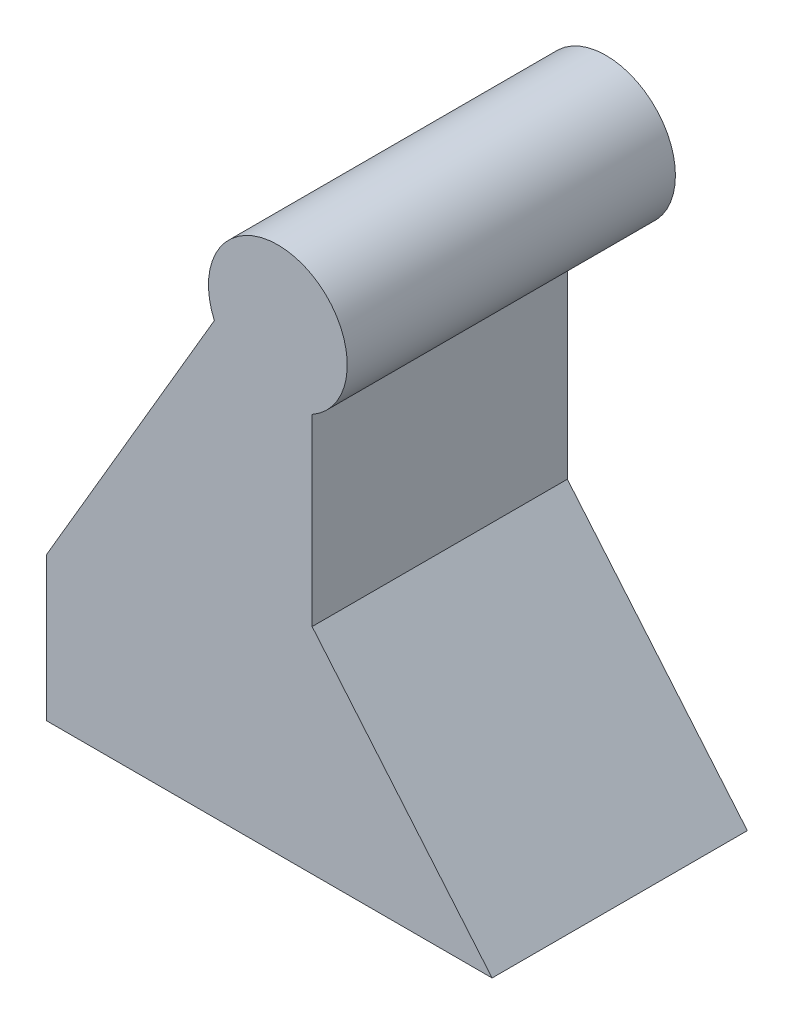
ISO-10303-21;
HEADER;
FILE_DESCRIPTION(('STEP AP214'),'2;1');
FILE_NAME('part.step','',(''),(''),'','','');
FILE_SCHEMA(('AUTOMOTIVE_DESIGN { 1 0 10303 214 1 1 1 1 }'));
ENDSEC;
DATA;
#1=APPLICATION_CONTEXT('core data for automotive mechanical design processes');
#2=APPLICATION_PROTOCOL_DEFINITION('international standard','automotive_design',2000,#1);
#3=PRODUCT_CONTEXT('',#1,'mechanical');
#4=PRODUCT('Part','Part','',(#3));
#5=PRODUCT_RELATED_PRODUCT_CATEGORY('part','',(#4));
#6=PRODUCT_DEFINITION_FORMATION('','',#4);
#7=PRODUCT_DEFINITION_CONTEXT('part definition',#1,'design');
#8=PRODUCT_DEFINITION('design','',#6,#7);
#9=PRODUCT_DEFINITION_SHAPE('','',#8);
#10=(LENGTH_UNIT() NAMED_UNIT(*) SI_UNIT(.MILLI.,.METRE.));
#11=(NAMED_UNIT(*) PLANE_ANGLE_UNIT() SI_UNIT($,.RADIAN.));
#12=(NAMED_UNIT(*) SI_UNIT($,.STERADIAN.) SOLID_ANGLE_UNIT());
#13=UNCERTAINTY_MEASURE_WITH_UNIT(LENGTH_MEASURE(1.E-05),#10,'distance_accuracy_value','');
#14=(GEOMETRIC_REPRESENTATION_CONTEXT(3) GLOBAL_UNCERTAINTY_ASSIGNED_CONTEXT((#13)) GLOBAL_UNIT_ASSIGNED_CONTEXT((#10,
#11,#12)) REPRESENTATION_CONTEXT('',''));
#15=CARTESIAN_POINT('',(0.,0.,0.));
#16=DIRECTION('',(0.,0.,1.));
#17=DIRECTION('',(1.,0.,0.));
#18=AXIS2_PLACEMENT_3D('',#15,#16,#17);
#19=CARTESIAN_POINT('',(-74.3157696242232,-7.94999958746374,10.));
#20=DIRECTION('',(0.,0.,-1.));
#21=DIRECTION('',(-1.,0.,0.));
#22=AXIS2_PLACEMENT_3D('',#19,#20,#21);
#23=CYLINDRICAL_SURFACE('',#22,9.51674665320932);
#24=CARTESIAN_POINT('',(-74.3157696242232,-7.94999958746374,-10.));
#25=DIRECTION('',(0.,0.,1.));
#26=DIRECTION('',(1.,0.,0.));
#27=AXIS2_PLACEMENT_3D('',#24,#25,#26);
#28=CIRCLE('',#27,9.51674665320932);
#29=CARTESIAN_POINT('',(-64.7990229710139,-7.94999958746374,-10.));
#30=VERTEX_POINT('',#29);
#31=EDGE_CURVE('E92',#30,#30,#28,.T.);
#32=ORIENTED_EDGE('',*,*,#31,.T.);
#33=EDGE_LOOP('',(#32));
#34=FACE_BOUND('',#33,.T.);
#35=DIRECTION('',(0.,0.,-1.));
#36=VECTOR('',#35,1.);
#37=CARTESIAN_POINT('',(-83.025654753467,-11.7848878383452,10.));
#38=LINE('',#37,#36);
#39=CARTESIAN_POINT('',(-83.025654753467,-11.7848878383452,35.));
#40=VERTEX_POINT('',#39);
#41=CARTESIAN_POINT('',(-83.025654753467,-11.7848878383452,0.));
#42=VERTEX_POINT('',#41);
#43=EDGE_CURVE('E11',#40,#42,#38,.T.);
#44=ORIENTED_EDGE('',*,*,#43,.F.);
#45=CARTESIAN_POINT('',(-74.3157696242232,-7.94999958746374,35.));
#46=DIRECTION('',(0.,0.,1.));
#47=DIRECTION('',(1.,0.,0.));
#48=AXIS2_PLACEMENT_3D('',#45,#46,#47);
#49=CIRCLE('',#48,9.51674665320932);
#50=CARTESIAN_POINT('',(-69.6204400406327,-16.2278221853956,35.));
#51=VERTEX_POINT('',#50);
#52=EDGE_CURVE('E94',#51,#40,#49,.T.);
#53=ORIENTED_EDGE('',*,*,#52,.F.);
#54=DIRECTION('',(0.,0.,-1.));
#55=VECTOR('',#54,1.);
#56=CARTESIAN_POINT('',(-69.6204400406327,-16.2278221853956,10.));
#57=LINE('',#56,#55);
#58=CARTESIAN_POINT('',(-69.6204400406327,-16.2278221853956,0.));
#59=VERTEX_POINT('',#58);
#60=EDGE_CURVE('E40',#59,#51,#57,.F.);
#61=ORIENTED_EDGE('',*,*,#60,.F.);
#62=CARTESIAN_POINT('',(-74.3157696242232,-7.94999958746374,0.));
#63=DIRECTION('',(0.,0.,-1.));
#64=DIRECTION('',(1.,0.,0.));
#65=AXIS2_PLACEMENT_3D('',#62,#63,#64);
#66=CIRCLE('',#65,9.51674665320932);
#67=EDGE_CURVE('E47',#59,#42,#66,.T.);
#68=ORIENTED_EDGE('',*,*,#67,.T.);
#69=EDGE_LOOP('',(#44,#53,#61,#68));
#70=FACE_BOUND('',#69,.T.);
#71=ADVANCED_FACE('F33',(#34,#70),#23,.T.);
#72=CARTESIAN_POINT('',(-74.3157696242232,-7.94999958746374,10.));
#73=DIRECTION('',(0.,0.,-1.));
#74=DIRECTION('',(-1.,0.,0.));
#75=AXIS2_PLACEMENT_3D('',#72,#73,#74);
#76=CYLINDRICAL_SURFACE('',#75,4.30973614586794);
#77=CARTESIAN_POINT('',(-74.3157696242232,-7.94999958746374,10.));
#78=DIRECTION('',(0.,0.,1.));
#79=DIRECTION('',(1.,0.,0.));
#80=AXIS2_PLACEMENT_3D('',#77,#78,#79);
#81=CIRCLE('',#80,4.30973614586794);
#82=CARTESIAN_POINT('',(-70.0060334783553,-7.94999958746374,10.));
#83=VERTEX_POINT('',#82);
#84=EDGE_CURVE('E96',#83,#83,#81,.T.);
#85=ORIENTED_EDGE('',*,*,#84,.T.);
#86=EDGE_LOOP('',(#85));
#87=FACE_BOUND('',#86,.T.);
#88=CARTESIAN_POINT('',(-74.3157696242232,-7.94999958746374,-10.));
#89=DIRECTION('',(0.,0.,1.));
#90=DIRECTION('',(1.,0.,0.));
#91=AXIS2_PLACEMENT_3D('',#88,#89,#90);
#92=CIRCLE('',#91,4.30973614586794);
#93=CARTESIAN_POINT('',(-70.0060334783553,-7.94999958746374,-10.));
#94=VERTEX_POINT('',#93);
#95=EDGE_CURVE('E113',#94,#94,#92,.T.);
#96=ORIENTED_EDGE('',*,*,#95,.F.);
#97=EDGE_LOOP('',(#96));
#98=FACE_BOUND('',#97,.T.);
#99=ADVANCED_FACE('F123',(#87,#98),#76,.F.);
#100=CARTESIAN_POINT('',(-74.3157696242232,-7.94999958746374,-10.));
#101=DIRECTION('',(0.,0.,1.));
#102=DIRECTION('',(1.,0.,0.));
#103=AXIS2_PLACEMENT_3D('',#100,#101,#102);
#104=PLANE('',#103);
#105=ORIENTED_EDGE('',*,*,#95,.T.);
#106=EDGE_LOOP('',(#105));
#107=FACE_BOUND('',#106,.T.);
#108=ORIENTED_EDGE('',*,*,#31,.F.);
#109=EDGE_LOOP('',(#108));
#110=FACE_BOUND('',#109,.T.);
#111=ADVANCED_FACE('F120',(#107,#110),#104,.F.);
#112=CARTESIAN_POINT('',(-83.025654753467,-11.7848878383452,35.));
#113=DIRECTION('',(0.862908086086389,-0.505360895763339,0.));
#114=DIRECTION('',(0.505360895763339,0.862908086086389,0.));
#115=AXIS2_PLACEMENT_3D('',#112,#113,#114);
#116=PLANE('',#115);
#117=DIRECTION('',(-0.505360895763339,-0.862908086086389,0.));
#118=VECTOR('',#117,1.);
#119=CARTESIAN_POINT('',(-83.025654753467,-11.7848878383452,35.));
#120=LINE('',#119,#118);
#121=CARTESIAN_POINT('',(-106.019653854858,-51.0473395286033,35.));
#122=VERTEX_POINT('',#121);
#123=EDGE_CURVE('E270',#40,#122,#120,.T.);
#124=ORIENTED_EDGE('',*,*,#123,.F.);
#125=ORIENTED_EDGE('',*,*,#43,.T.);
#126=DIRECTION('',(-0.505360895763339,-0.862908086086389,0.));
#127=VECTOR('',#126,1.);
#128=CARTESIAN_POINT('',(-83.025654753467,-11.7848878383452,0.));
#129=LINE('',#128,#127);
#130=CARTESIAN_POINT('',(-106.019653854858,-51.0473395286033,0.));
#131=VERTEX_POINT('',#130);
#132=EDGE_CURVE('E255',#42,#131,#129,.T.);
#133=ORIENTED_EDGE('',*,*,#132,.T.);
#134=DIRECTION('',(0.,0.,-1.));
#135=VECTOR('',#134,1.);
#136=CARTESIAN_POINT('',(-106.019653854858,-51.0473395286033,35.));
#137=LINE('',#136,#135);
#138=EDGE_CURVE('E111',#122,#131,#137,.T.);
#139=ORIENTED_EDGE('',*,*,#138,.F.);
#140=EDGE_LOOP('',(#124,#125,#133,#139));
#141=FACE_BOUND('',#140,.T.);
#142=ADVANCED_FACE('F122',(#141),#116,.F.);
#143=CARTESIAN_POINT('',(-106.019653854858,-51.0473395286033,35.));
#144=DIRECTION('',(1.,0.,0.));
#145=DIRECTION('',(0.,0.,-1.));
#146=AXIS2_PLACEMENT_3D('',#143,#144,#145);
#147=PLANE('',#146);
#148=ORIENTED_EDGE('',*,*,#138,.T.);
#149=DIRECTION('',(0.,-1.,0.));
#150=VECTOR('',#149,1.);
#151=CARTESIAN_POINT('',(-106.019653854858,-51.0473395286033,0.));
#152=LINE('',#151,#150);
#153=CARTESIAN_POINT('',(-106.019653854858,-70.8153631264636,0.));
#154=VERTEX_POINT('',#153);
#155=EDGE_CURVE('E260',#131,#154,#152,.T.);
#156=ORIENTED_EDGE('',*,*,#155,.T.);
#157=DIRECTION('',(0.,0.,-1.));
#158=VECTOR('',#157,1.);
#159=CARTESIAN_POINT('',(-106.019653854858,-70.8153631264636,35.));
#160=LINE('',#159,#158);
#161=CARTESIAN_POINT('',(-106.019653854858,-70.8153631264636,35.));
#162=VERTEX_POINT('',#161);
#163=EDGE_CURVE('E108',#162,#154,#160,.T.);
#164=ORIENTED_EDGE('',*,*,#163,.F.);
#165=DIRECTION('',(0.,-1.,0.));
#166=VECTOR('',#165,1.);
#167=CARTESIAN_POINT('',(-106.019653854858,-51.0473395286033,35.));
#168=LINE('',#167,#166);
#169=EDGE_CURVE('E272',#122,#162,#168,.T.);
#170=ORIENTED_EDGE('',*,*,#169,.F.);
#171=EDGE_LOOP('',(#148,#156,#164,#170));
#172=FACE_BOUND('',#171,.T.);
#173=ADVANCED_FACE('F130',(#172),#147,.F.);
#174=CARTESIAN_POINT('',(-106.019653854858,-70.8153631264636,35.));
#175=DIRECTION('',(0.,1.,0.));
#176=DIRECTION('',(0.,0.,1.));
#177=AXIS2_PLACEMENT_3D('',#174,#175,#176);
#178=PLANE('',#177);
#179=ORIENTED_EDGE('',*,*,#163,.T.);
#180=DIRECTION('',(1.,0.,0.));
#181=VECTOR('',#180,1.);
#182=CARTESIAN_POINT('',(-106.019653854858,-70.8153631264636,0.));
#183=LINE('',#182,#181);
#184=CARTESIAN_POINT('',(-44.9384550358403,-70.8153631264636,0.));
#185=VERTEX_POINT('',#184);
#186=EDGE_CURVE('E263',#154,#185,#183,.T.);
#187=ORIENTED_EDGE('',*,*,#186,.T.);
#188=DIRECTION('',(0.,0.,-1.));
#189=VECTOR('',#188,1.);
#190=CARTESIAN_POINT('',(-44.9384550358403,-70.8153631264636,35.));
#191=LINE('',#190,#189);
#192=CARTESIAN_POINT('',(-44.9384550358403,-70.8153631264636,35.));
#193=VERTEX_POINT('',#192);
#194=EDGE_CURVE('E101',#193,#185,#191,.T.);
#195=ORIENTED_EDGE('',*,*,#194,.F.);
#196=DIRECTION('',(1.,0.,0.));
#197=VECTOR('',#196,1.);
#198=CARTESIAN_POINT('',(-106.019653854858,-70.8153631264636,35.));
#199=LINE('',#198,#197);
#200=EDGE_CURVE('E103',#162,#193,#199,.T.);
#201=ORIENTED_EDGE('',*,*,#200,.F.);
#202=EDGE_LOOP('',(#179,#187,#195,#201));
#203=FACE_BOUND('',#202,.T.);
#204=ADVANCED_FACE('F165',(#203),#178,.F.);
#205=CARTESIAN_POINT('',(-44.9384550358403,-70.8153631264636,35.));
#206=DIRECTION('',(-0.765798087176186,-0.643081091058736,0.));
#207=DIRECTION('',(0.643081091058736,-0.765798087176186,0.));
#208=AXIS2_PLACEMENT_3D('',#205,#206,#207);
#209=PLANE('',#208);
#210=ORIENTED_EDGE('',*,*,#194,.T.);
#211=DIRECTION('',(-0.643081091058736,0.765798087176186,0.));
#212=VECTOR('',#211,1.);
#213=CARTESIAN_POINT('',(-44.9384550358403,-70.8153631264636,0.));
#214=LINE('',#213,#212);
#215=CARTESIAN_POINT('',(-69.6204400406327,-41.4233981516219,0.));
#216=VERTEX_POINT('',#215);
#217=EDGE_CURVE('E266',#185,#216,#214,.T.);
#218=ORIENTED_EDGE('',*,*,#217,.T.);
#219=DIRECTION('',(0.,0.,-1.));
#220=VECTOR('',#219,1.);
#221=CARTESIAN_POINT('',(-69.6204400406327,-41.4233981516219,35.));
#222=LINE('',#221,#220);
#223=CARTESIAN_POINT('',(-69.6204400406327,-41.4233981516219,35.));
#224=VERTEX_POINT('',#223);
#225=EDGE_CURVE('E99',#224,#216,#222,.T.);
#226=ORIENTED_EDGE('',*,*,#225,.F.);
#227=DIRECTION('',(-0.643081091058736,0.765798087176186,0.));
#228=VECTOR('',#227,1.);
#229=CARTESIAN_POINT('',(-44.9384550358403,-70.8153631264636,35.));
#230=LINE('',#229,#228);
#231=EDGE_CURVE('E54',#193,#224,#230,.T.);
#232=ORIENTED_EDGE('',*,*,#231,.F.);
#233=EDGE_LOOP('',(#210,#218,#226,#232));
#234=FACE_BOUND('',#233,.T.);
#235=ADVANCED_FACE('F175',(#234),#209,.F.);
#236=CARTESIAN_POINT('',(-69.6204400406327,-41.4233981516219,35.));
#237=DIRECTION('',(-1.,0.,0.));
#238=DIRECTION('',(0.,0.,1.));
#239=AXIS2_PLACEMENT_3D('',#236,#237,#238);
#240=PLANE('',#239);
#241=ORIENTED_EDGE('',*,*,#225,.T.);
#242=DIRECTION('',(0.,1.,0.));
#243=VECTOR('',#242,1.);
#244=CARTESIAN_POINT('',(-69.6204400406327,-41.4233981516219,0.));
#245=LINE('',#244,#243);
#246=EDGE_CURVE('E91',#216,#59,#245,.T.);
#247=ORIENTED_EDGE('',*,*,#246,.T.);
#248=ORIENTED_EDGE('',*,*,#60,.T.);
#249=DIRECTION('',(0.,1.,0.));
#250=VECTOR('',#249,1.);
#251=CARTESIAN_POINT('',(-69.6204400406327,-41.4233981516219,35.));
#252=LINE('',#251,#250);
#253=EDGE_CURVE('E89',#224,#51,#252,.T.);
#254=ORIENTED_EDGE('',*,*,#253,.F.);
#255=EDGE_LOOP('',(#241,#247,#248,#254));
#256=FACE_BOUND('',#255,.T.);
#257=ADVANCED_FACE('F88',(#256),#240,.F.);
#258=CARTESIAN_POINT('',(-74.3157696242232,-7.94999958746374,35.));
#259=DIRECTION('',(0.,0.,1.));
#260=DIRECTION('',(1.,0.,0.));
#261=AXIS2_PLACEMENT_3D('',#258,#259,#260);
#262=PLANE('',#261);
#263=ORIENTED_EDGE('',*,*,#253,.T.);
#264=ORIENTED_EDGE('',*,*,#52,.T.);
#265=ORIENTED_EDGE('',*,*,#123,.T.);
#266=ORIENTED_EDGE('',*,*,#169,.T.);
#267=ORIENTED_EDGE('',*,*,#200,.T.);
#268=ORIENTED_EDGE('',*,*,#231,.T.);
#269=EDGE_LOOP('',(#263,#264,#265,#266,#267,#268));
#270=FACE_BOUND('',#269,.T.);
#271=ADVANCED_FACE('F98',(#270),#262,.T.);
#272=CARTESIAN_POINT('',(-74.3157696242232,-7.94999958746374,0.));
#273=DIRECTION('',(0.,0.,1.));
#274=DIRECTION('',(1.,0.,0.));
#275=AXIS2_PLACEMENT_3D('',#272,#273,#274);
#276=PLANE('',#275);
#277=ORIENTED_EDGE('',*,*,#67,.F.);
#278=ORIENTED_EDGE('',*,*,#246,.F.);
#279=ORIENTED_EDGE('',*,*,#217,.F.);
#280=ORIENTED_EDGE('',*,*,#186,.F.);
#281=ORIENTED_EDGE('',*,*,#155,.F.);
#282=ORIENTED_EDGE('',*,*,#132,.F.);
#283=EDGE_LOOP('',(#277,#278,#279,#280,#281,#282));
#284=FACE_BOUND('',#283,.T.);
#285=ADVANCED_FACE('F149',(#284),#276,.F.);
#286=CARTESIAN_POINT('',(-74.3157696242232,-7.94999958746374,10.));
#287=DIRECTION('',(0.,0.,1.));
#288=DIRECTION('',(1.,0.,0.));
#289=AXIS2_PLACEMENT_3D('',#286,#287,#288);
#290=PLANE('',#289);
#291=ORIENTED_EDGE('',*,*,#84,.F.);
#292=EDGE_LOOP('',(#291));
#293=FACE_BOUND('',#292,.T.);
#294=ADVANCED_FACE('F198',(#293),#290,.F.);
#295=CLOSED_SHELL('',(#71,#99,#111,#142,#173,#204,#235,#257,#271,#285,#294));
#296=MANIFOLD_SOLID_BREP('B2',#295);
#297=ADVANCED_BREP_SHAPE_REPRESENTATION('',(#18,#296),#14);
#298=SHAPE_DEFINITION_REPRESENTATION(#9,#297);
ENDSEC;
END-ISO-10303-21;
